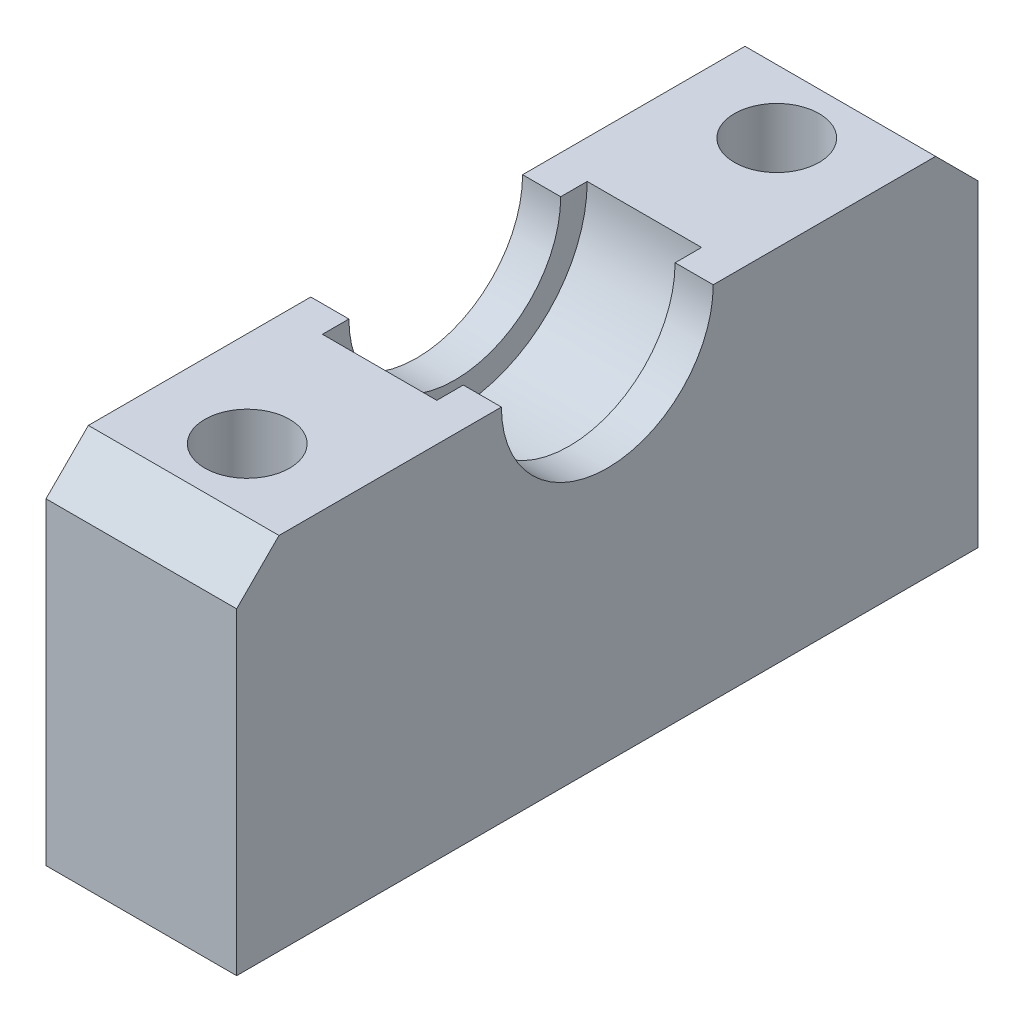
ISO-10303-21;
HEADER;
FILE_DESCRIPTION(('STEP AP214'),'2;1');
FILE_NAME('part.step','',(''),(''),'','','');
FILE_SCHEMA(('AUTOMOTIVE_DESIGN { 1 0 10303 214 1 1 1 1 }'));
ENDSEC;
DATA;
#1=APPLICATION_CONTEXT('core data for automotive mechanical design processes');
#2=APPLICATION_PROTOCOL_DEFINITION('international standard','automotive_design',2000,#1);
#3=PRODUCT_CONTEXT('',#1,'mechanical');
#4=PRODUCT('Part','Part','',(#3));
#5=PRODUCT_RELATED_PRODUCT_CATEGORY('part','',(#4));
#6=PRODUCT_DEFINITION_FORMATION('','',#4);
#7=PRODUCT_DEFINITION_CONTEXT('part definition',#1,'design');
#8=PRODUCT_DEFINITION('design','',#6,#7);
#9=PRODUCT_DEFINITION_SHAPE('','',#8);
#10=(LENGTH_UNIT() NAMED_UNIT(*) SI_UNIT(.MILLI.,.METRE.));
#11=(NAMED_UNIT(*) PLANE_ANGLE_UNIT() SI_UNIT($,.RADIAN.));
#12=(NAMED_UNIT(*) SI_UNIT($,.STERADIAN.) SOLID_ANGLE_UNIT());
#13=UNCERTAINTY_MEASURE_WITH_UNIT(LENGTH_MEASURE(1.E-05),#10,'distance_accuracy_value','');
#14=(GEOMETRIC_REPRESENTATION_CONTEXT(3) GLOBAL_UNCERTAINTY_ASSIGNED_CONTEXT((#13)) GLOBAL_UNIT_ASSIGNED_CONTEXT((#10,
#11,#12)) REPRESENTATION_CONTEXT('',''));
#15=CARTESIAN_POINT('',(0.,0.,0.));
#16=DIRECTION('',(0.,0.,1.));
#17=DIRECTION('',(1.,0.,0.));
#18=AXIS2_PLACEMENT_3D('',#15,#16,#17);
#19=CARTESIAN_POINT('',(-4.5,8.5,0.));
#20=DIRECTION('',(1.,0.,0.));
#21=DIRECTION('',(0.,0.,-1.));
#22=AXIS2_PLACEMENT_3D('',#19,#20,#21);
#23=CYLINDRICAL_SURFACE('',#22,5.);
#24=DIRECTION('',(1.,0.,0.));
#25=VECTOR('',#24,1.);
#26=CARTESIAN_POINT('',(-4.5,8.5,5.));
#27=LINE('',#26,#25);
#28=CARTESIAN_POINT('',(-4.5,8.5,5.));
#29=VERTEX_POINT('',#28);
#30=CARTESIAN_POINT('',(-2.7,8.5,5.));
#31=VERTEX_POINT('',#30);
#32=EDGE_CURVE('E222',#29,#31,#27,.T.);
#33=ORIENTED_EDGE('',*,*,#32,.T.);
#34=CARTESIAN_POINT('',(-2.7,8.5,0.));
#35=DIRECTION('',(1.,0.,0.));
#36=DIRECTION('',(0.,0.,-1.));
#37=AXIS2_PLACEMENT_3D('',#34,#35,#36);
#38=CIRCLE('',#37,5.);
#39=CARTESIAN_POINT('',(-2.7,8.5,-5.));
#40=VERTEX_POINT('',#39);
#41=EDGE_CURVE('E141',#31,#40,#38,.T.);
#42=ORIENTED_EDGE('',*,*,#41,.T.);
#43=DIRECTION('',(1.,0.,0.));
#44=VECTOR('',#43,1.);
#45=CARTESIAN_POINT('',(-4.5,8.5,-5.));
#46=LINE('',#45,#44);
#47=CARTESIAN_POINT('',(-4.5,8.5,-5.));
#48=VERTEX_POINT('',#47);
#49=EDGE_CURVE('E226',#48,#40,#46,.T.);
#50=ORIENTED_EDGE('',*,*,#49,.F.);
#51=CARTESIAN_POINT('',(-4.5,8.5,0.));
#52=DIRECTION('',(-1.,0.,0.));
#53=DIRECTION('',(0.,0.,-1.));
#54=AXIS2_PLACEMENT_3D('',#51,#52,#53);
#55=CIRCLE('',#54,5.);
#56=EDGE_CURVE('E199',#48,#29,#55,.T.);
#57=ORIENTED_EDGE('',*,*,#56,.T.);
#58=EDGE_LOOP('',(#33,#42,#50,#57));
#59=FACE_BOUND('',#58,.T.);
#60=ADVANCED_FACE('F45',(#59),#23,.F.);
#61=CARTESIAN_POINT('',(-4.5,-8.5,-17.5));
#62=DIRECTION('',(0.,0.,-1.));
#63=DIRECTION('',(-1.,0.,0.));
#64=AXIS2_PLACEMENT_3D('',#61,#62,#63);
#65=PLANE('',#64);
#66=DIRECTION('',(0.,1.,0.));
#67=VECTOR('',#66,1.);
#68=CARTESIAN_POINT('',(-4.5,-8.5,-17.5));
#69=LINE('',#68,#67);
#70=CARTESIAN_POINT('',(-4.5,-8.5,-17.5));
#71=VERTEX_POINT('',#70);
#72=CARTESIAN_POINT('',(-4.5,6.5,-17.5));
#73=VERTEX_POINT('',#72);
#74=EDGE_CURVE('E192',#71,#73,#69,.T.);
#75=ORIENTED_EDGE('',*,*,#74,.T.);
#76=DIRECTION('',(1.,0.,0.));
#77=VECTOR('',#76,1.);
#78=CARTESIAN_POINT('',(-4.5,6.5,-17.5));
#79=LINE('',#78,#77);
#80=CARTESIAN_POINT('',(4.5,6.5,-17.5));
#81=VERTEX_POINT('',#80);
#82=EDGE_CURVE('E237',#73,#81,#79,.T.);
#83=ORIENTED_EDGE('',*,*,#82,.T.);
#84=DIRECTION('',(0.,1.,0.));
#85=VECTOR('',#84,1.);
#86=CARTESIAN_POINT('',(4.5,-8.5,-17.5));
#87=LINE('',#86,#85);
#88=CARTESIAN_POINT('',(4.5,-8.5,-17.5));
#89=VERTEX_POINT('',#88);
#90=EDGE_CURVE('E165',#89,#81,#87,.T.);
#91=ORIENTED_EDGE('',*,*,#90,.F.);
#92=DIRECTION('',(1.,0.,0.));
#93=VECTOR('',#92,1.);
#94=CARTESIAN_POINT('',(-4.5,-8.5,-17.5));
#95=LINE('',#94,#93);
#96=EDGE_CURVE('E214',#71,#89,#95,.T.);
#97=ORIENTED_EDGE('',*,*,#96,.F.);
#98=EDGE_LOOP('',(#75,#83,#91,#97));
#99=FACE_BOUND('',#98,.T.);
#100=ADVANCED_FACE('F319',(#99),#65,.T.);
#101=CARTESIAN_POINT('',(-4.5,-8.5,17.5));
#102=DIRECTION('',(0.,-1.,0.));
#103=DIRECTION('',(0.,0.,-1.));
#104=AXIS2_PLACEMENT_3D('',#101,#102,#103);
#105=PLANE('',#104);
#106=CARTESIAN_POINT('',(0.,-8.5,-12.5));
#107=DIRECTION('',(0.,1.,0.));
#108=DIRECTION('',(0.,0.,1.));
#109=AXIS2_PLACEMENT_3D('',#106,#107,#108);
#110=CIRCLE('',#109,2.);
#111=CARTESIAN_POINT('',(0.,-8.5,-10.5));
#112=VERTEX_POINT('',#111);
#113=EDGE_CURVE('E158',#112,#112,#110,.T.);
#114=ORIENTED_EDGE('',*,*,#113,.T.);
#115=EDGE_LOOP('',(#114));
#116=FACE_BOUND('',#115,.T.);
#117=CARTESIAN_POINT('',(0.,-8.5,12.5));
#118=DIRECTION('',(0.,1.,0.));
#119=DIRECTION('',(0.,0.,1.));
#120=AXIS2_PLACEMENT_3D('',#117,#118,#119);
#121=CIRCLE('',#120,2.);
#122=CARTESIAN_POINT('',(0.,-8.5,14.5));
#123=VERTEX_POINT('',#122);
#124=EDGE_CURVE('E282',#123,#123,#121,.T.);
#125=ORIENTED_EDGE('',*,*,#124,.T.);
#126=EDGE_LOOP('',(#125));
#127=FACE_BOUND('',#126,.T.);
#128=ORIENTED_EDGE('',*,*,#96,.T.);
#129=DIRECTION('',(0.,0.,-1.));
#130=VECTOR('',#129,1.);
#131=CARTESIAN_POINT('',(4.5,-8.5,17.5));
#132=LINE('',#131,#130);
#133=CARTESIAN_POINT('',(4.5,-8.5,17.5));
#134=VERTEX_POINT('',#133);
#135=EDGE_CURVE('E188',#134,#89,#132,.T.);
#136=ORIENTED_EDGE('',*,*,#135,.F.);
#137=DIRECTION('',(1.,0.,0.));
#138=VECTOR('',#137,1.);
#139=CARTESIAN_POINT('',(-4.5,-8.5,17.5));
#140=LINE('',#139,#138);
#141=CARTESIAN_POINT('',(-4.5,-8.5,17.5));
#142=VERTEX_POINT('',#141);
#143=EDGE_CURVE('E218',#142,#134,#140,.T.);
#144=ORIENTED_EDGE('',*,*,#143,.F.);
#145=DIRECTION('',(0.,0.,-1.));
#146=VECTOR('',#145,1.);
#147=CARTESIAN_POINT('',(-4.5,-8.5,17.5));
#148=LINE('',#147,#146);
#149=EDGE_CURVE('E209',#142,#71,#148,.T.);
#150=ORIENTED_EDGE('',*,*,#149,.T.);
#151=EDGE_LOOP('',(#128,#136,#144,#150));
#152=FACE_BOUND('',#151,.T.);
#153=ADVANCED_FACE('F298',(#116,#127,#152),#105,.T.);
#154=CARTESIAN_POINT('',(-4.5,-8.5,17.5));
#155=DIRECTION('',(0.,0.,1.));
#156=DIRECTION('',(1.,0.,0.));
#157=AXIS2_PLACEMENT_3D('',#154,#155,#156);
#158=PLANE('',#157);
#159=DIRECTION('',(0.,-1.,0.));
#160=VECTOR('',#159,1.);
#161=CARTESIAN_POINT('',(4.5,-8.5,17.5));
#162=LINE('',#161,#160);
#163=CARTESIAN_POINT('',(4.5,6.49999999999999,17.5));
#164=VERTEX_POINT('',#163);
#165=EDGE_CURVE('E185',#164,#134,#162,.T.);
#166=ORIENTED_EDGE('',*,*,#165,.F.);
#167=DIRECTION('',(-1.,0.,0.));
#168=VECTOR('',#167,1.);
#169=CARTESIAN_POINT('',(-4.5,6.49999999999999,17.5));
#170=LINE('',#169,#168);
#171=CARTESIAN_POINT('',(-4.5,6.49999999999999,17.5));
#172=VERTEX_POINT('',#171);
#173=EDGE_CURVE('E11',#164,#172,#170,.T.);
#174=ORIENTED_EDGE('',*,*,#173,.T.);
#175=DIRECTION('',(0.,-1.,0.));
#176=VECTOR('',#175,1.);
#177=CARTESIAN_POINT('',(-4.5,-8.5,17.5));
#178=LINE('',#177,#176);
#179=EDGE_CURVE('E206',#172,#142,#178,.T.);
#180=ORIENTED_EDGE('',*,*,#179,.T.);
#181=ORIENTED_EDGE('',*,*,#143,.T.);
#182=EDGE_LOOP('',(#166,#174,#180,#181));
#183=FACE_BOUND('',#182,.T.);
#184=ADVANCED_FACE('F328',(#183),#158,.T.);
#185=CARTESIAN_POINT('',(-4.5,8.5,17.5));
#186=DIRECTION('',(0.,1.,0.));
#187=DIRECTION('',(0.,0.,1.));
#188=AXIS2_PLACEMENT_3D('',#185,#186,#187);
#189=PLANE('',#188);
#190=CARTESIAN_POINT('',(0.,8.5,12.5));
#191=DIRECTION('',(0.,1.,0.));
#192=DIRECTION('',(0.,0.,1.));
#193=AXIS2_PLACEMENT_3D('',#190,#191,#192);
#194=CIRCLE('',#193,2.);
#195=CARTESIAN_POINT('',(0.,8.5,14.5));
#196=VERTEX_POINT('',#195);
#197=EDGE_CURVE('E286',#196,#196,#194,.T.);
#198=ORIENTED_EDGE('',*,*,#197,.F.);
#199=EDGE_LOOP('',(#198));
#200=FACE_BOUND('',#199,.T.);
#201=DIRECTION('',(0.,0.,1.));
#202=VECTOR('',#201,1.);
#203=CARTESIAN_POINT('',(-4.5,8.5,17.5));
#204=LINE('',#203,#202);
#205=CARTESIAN_POINT('',(-4.5,8.5,15.5));
#206=VERTEX_POINT('',#205);
#207=EDGE_CURVE('E203',#29,#206,#204,.T.);
#208=ORIENTED_EDGE('',*,*,#207,.T.);
#209=DIRECTION('',(1.,0.,0.));
#210=VECTOR('',#209,1.);
#211=CARTESIAN_POINT('',(-4.5,8.5,15.5));
#212=LINE('',#211,#210);
#213=CARTESIAN_POINT('',(4.5,8.5,15.5));
#214=VERTEX_POINT('',#213);
#215=EDGE_CURVE('E55',#206,#214,#212,.T.);
#216=ORIENTED_EDGE('',*,*,#215,.T.);
#217=DIRECTION('',(0.,0.,1.));
#218=VECTOR('',#217,1.);
#219=CARTESIAN_POINT('',(4.5,8.5,17.5));
#220=LINE('',#219,#218);
#221=CARTESIAN_POINT('',(4.5,8.5,5.));
#222=VERTEX_POINT('',#221);
#223=EDGE_CURVE('E181',#222,#214,#220,.T.);
#224=ORIENTED_EDGE('',*,*,#223,.F.);
#225=CARTESIAN_POINT('',(2.7,8.5,5.));
#226=VERTEX_POINT('',#225);
#227=EDGE_CURVE('E225',#226,#222,#27,.T.);
#228=ORIENTED_EDGE('',*,*,#227,.F.);
#229=DIRECTION('',(0.,0.,-1.));
#230=VECTOR('',#229,1.);
#231=CARTESIAN_POINT('',(2.7,8.5,17.5));
#232=LINE('',#231,#230);
#233=CARTESIAN_POINT('',(2.7,8.5,6.25));
#234=VERTEX_POINT('',#233);
#235=EDGE_CURVE('E163',#234,#226,#232,.T.);
#236=ORIENTED_EDGE('',*,*,#235,.F.);
#237=DIRECTION('',(-1.,0.,0.));
#238=VECTOR('',#237,1.);
#239=CARTESIAN_POINT('',(2.7,8.5,6.25));
#240=LINE('',#239,#238);
#241=CARTESIAN_POINT('',(-2.7,8.5,6.25));
#242=VERTEX_POINT('',#241);
#243=EDGE_CURVE('E151',#234,#242,#240,.T.);
#244=ORIENTED_EDGE('',*,*,#243,.T.);
#245=DIRECTION('',(0.,0.,-1.));
#246=VECTOR('',#245,1.);
#247=CARTESIAN_POINT('',(-2.7,8.5,17.5));
#248=LINE('',#247,#246);
#249=EDGE_CURVE('E135',#242,#31,#248,.T.);
#250=ORIENTED_EDGE('',*,*,#249,.T.);
#251=ORIENTED_EDGE('',*,*,#32,.F.);
#252=EDGE_LOOP('',(#208,#216,#224,#228,#236,#244,#250,#251));
#253=FACE_BOUND('',#252,.T.);
#254=ADVANCED_FACE('F161',(#200,#253),#189,.T.);
#255=CARTESIAN_POINT('',(2.7,8.5,0.));
#256=DIRECTION('',(1.,0.,0.));
#257=DIRECTION('',(0.,0.,-1.));
#258=AXIS2_PLACEMENT_3D('',#255,#256,#257);
#259=CIRCLE('',#258,5.);
#260=CARTESIAN_POINT('',(2.7,8.5,-5.));
#261=VERTEX_POINT('',#260);
#262=EDGE_CURVE('E146',#226,#261,#259,.T.);
#263=ORIENTED_EDGE('',*,*,#262,.F.);
#264=ORIENTED_EDGE('',*,*,#227,.T.);
#265=CARTESIAN_POINT('',(4.5,8.5,0.));
#266=DIRECTION('',(-1.,0.,0.));
#267=DIRECTION('',(0.,0.,-1.));
#268=AXIS2_PLACEMENT_3D('',#265,#266,#267);
#269=CIRCLE('',#268,5.);
#270=CARTESIAN_POINT('',(4.5,8.5,-5.));
#271=VERTEX_POINT('',#270);
#272=EDGE_CURVE('E177',#271,#222,#269,.T.);
#273=ORIENTED_EDGE('',*,*,#272,.F.);
#274=EDGE_CURVE('E213',#261,#271,#46,.T.);
#275=ORIENTED_EDGE('',*,*,#274,.F.);
#276=EDGE_LOOP('',(#263,#264,#273,#275));
#277=FACE_BOUND('',#276,.T.);
#278=ADVANCED_FACE('F267',(#277),#23,.F.);
#279=CARTESIAN_POINT('',(-4.5,8.5,-5.));
#280=DIRECTION('',(0.,1.,0.));
#281=DIRECTION('',(0.,0.,1.));
#282=AXIS2_PLACEMENT_3D('',#279,#280,#281);
#283=PLANE('',#282);
#284=CARTESIAN_POINT('',(0.,8.5,-12.5));
#285=DIRECTION('',(0.,1.,0.));
#286=DIRECTION('',(0.,0.,1.));
#287=AXIS2_PLACEMENT_3D('',#284,#285,#286);
#288=CIRCLE('',#287,2.);
#289=CARTESIAN_POINT('',(0.,8.5,-10.5));
#290=VERTEX_POINT('',#289);
#291=EDGE_CURVE('E290',#290,#290,#288,.T.);
#292=ORIENTED_EDGE('',*,*,#291,.F.);
#293=EDGE_LOOP('',(#292));
#294=FACE_BOUND('',#293,.T.);
#295=DIRECTION('',(0.,0.,1.));
#296=VECTOR('',#295,1.);
#297=CARTESIAN_POINT('',(4.5,8.5,-5.));
#298=LINE('',#297,#296);
#299=CARTESIAN_POINT('',(4.5,8.5,-15.5));
#300=VERTEX_POINT('',#299);
#301=EDGE_CURVE('E170',#300,#271,#298,.T.);
#302=ORIENTED_EDGE('',*,*,#301,.F.);
#303=DIRECTION('',(-1.,0.,0.));
#304=VECTOR('',#303,1.);
#305=CARTESIAN_POINT('',(-4.5,8.5,-15.5));
#306=LINE('',#305,#304);
#307=CARTESIAN_POINT('',(-4.5,8.5,-15.5));
#308=VERTEX_POINT('',#307);
#309=EDGE_CURVE('E247',#300,#308,#306,.T.);
#310=ORIENTED_EDGE('',*,*,#309,.T.);
#311=DIRECTION('',(0.,0.,1.));
#312=VECTOR('',#311,1.);
#313=CARTESIAN_POINT('',(-4.5,8.5,-5.));
#314=LINE('',#313,#312);
#315=EDGE_CURVE('E196',#308,#48,#314,.T.);
#316=ORIENTED_EDGE('',*,*,#315,.T.);
#317=ORIENTED_EDGE('',*,*,#49,.T.);
#318=DIRECTION('',(0.,0.,-1.));
#319=VECTOR('',#318,1.);
#320=CARTESIAN_POINT('',(-2.7,8.5,-5.));
#321=LINE('',#320,#319);
#322=CARTESIAN_POINT('',(-2.7,8.5,-6.25));
#323=VERTEX_POINT('',#322);
#324=EDGE_CURVE('E217',#40,#323,#321,.T.);
#325=ORIENTED_EDGE('',*,*,#324,.T.);
#326=DIRECTION('',(-1.,0.,0.));
#327=VECTOR('',#326,1.);
#328=CARTESIAN_POINT('',(2.7,8.5,-6.25));
#329=LINE('',#328,#327);
#330=CARTESIAN_POINT('',(2.7,8.5,-6.25));
#331=VERTEX_POINT('',#330);
#332=EDGE_CURVE('E154',#323,#331,#329,.F.);
#333=ORIENTED_EDGE('',*,*,#332,.T.);
#334=DIRECTION('',(0.,0.,-1.));
#335=VECTOR('',#334,1.);
#336=CARTESIAN_POINT('',(2.7,8.5,-5.));
#337=LINE('',#336,#335);
#338=EDGE_CURVE('E234',#261,#331,#337,.T.);
#339=ORIENTED_EDGE('',*,*,#338,.F.);
#340=ORIENTED_EDGE('',*,*,#274,.T.);
#341=EDGE_LOOP('',(#302,#310,#316,#317,#325,#333,#339,#340));
#342=FACE_BOUND('',#341,.T.);
#343=ADVANCED_FACE('F272',(#294,#342),#283,.T.);
#344=CARTESIAN_POINT('',(-4.5,8.5,0.));
#345=DIRECTION('',(1.,0.,0.));
#346=DIRECTION('',(0.,0.,-1.));
#347=AXIS2_PLACEMENT_3D('',#344,#345,#346);
#348=PLANE('',#347);
#349=ORIENTED_EDGE('',*,*,#315,.F.);
#350=DIRECTION('',(0.,0.707106781186547,0.707106781186548));
#351=VECTOR('',#350,1.);
#352=CARTESIAN_POINT('',(-4.5,6.5,-17.5));
#353=LINE('',#352,#351);
#354=EDGE_CURVE('E252',#308,#73,#353,.F.);
#355=ORIENTED_EDGE('',*,*,#354,.T.);
#356=ORIENTED_EDGE('',*,*,#74,.F.);
#357=ORIENTED_EDGE('',*,*,#149,.F.);
#358=ORIENTED_EDGE('',*,*,#179,.F.);
#359=DIRECTION('',(0.,-0.707106781186549,0.707106781186546));
#360=VECTOR('',#359,1.);
#361=CARTESIAN_POINT('',(-4.5,8.5,15.5));
#362=LINE('',#361,#360);
#363=EDGE_CURVE('E62',#172,#206,#362,.F.);
#364=ORIENTED_EDGE('',*,*,#363,.T.);
#365=ORIENTED_EDGE('',*,*,#207,.F.);
#366=ORIENTED_EDGE('',*,*,#56,.F.);
#367=EDGE_LOOP('',(#349,#355,#356,#357,#358,#364,#365,#366));
#368=FACE_BOUND('',#367,.T.);
#369=ADVANCED_FACE('F309',(#368),#348,.F.);
#370=CARTESIAN_POINT('',(4.5,8.5,0.));
#371=DIRECTION('',(1.,0.,0.));
#372=DIRECTION('',(0.,0.,-1.));
#373=AXIS2_PLACEMENT_3D('',#370,#371,#372);
#374=PLANE('',#373);
#375=ORIENTED_EDGE('',*,*,#90,.T.);
#376=DIRECTION('',(0.,-0.707106781186547,-0.707106781186548));
#377=VECTOR('',#376,1.);
#378=CARTESIAN_POINT('',(4.5,16.25,-7.74999999999999));
#379=LINE('',#378,#377);
#380=EDGE_CURVE('E244',#81,#300,#379,.F.);
#381=ORIENTED_EDGE('',*,*,#380,.T.);
#382=ORIENTED_EDGE('',*,*,#301,.T.);
#383=ORIENTED_EDGE('',*,*,#272,.T.);
#384=ORIENTED_EDGE('',*,*,#223,.T.);
#385=DIRECTION('',(0.,0.707106781186549,-0.707106781186546));
#386=VECTOR('',#385,1.);
#387=CARTESIAN_POINT('',(4.5,16.25,7.75000000000003));
#388=LINE('',#387,#386);
#389=EDGE_CURVE('E241',#214,#164,#388,.F.);
#390=ORIENTED_EDGE('',*,*,#389,.T.);
#391=ORIENTED_EDGE('',*,*,#165,.T.);
#392=ORIENTED_EDGE('',*,*,#135,.T.);
#393=EDGE_LOOP('',(#375,#381,#382,#383,#384,#390,#391,#392));
#394=FACE_BOUND('',#393,.T.);
#395=ADVANCED_FACE('F260',(#394),#374,.T.);
#396=CARTESIAN_POINT('',(2.7,8.5,0.));
#397=DIRECTION('',(-1.,0.,0.));
#398=DIRECTION('',(0.,0.,1.));
#399=AXIS2_PLACEMENT_3D('',#396,#397,#398);
#400=CYLINDRICAL_SURFACE('',#399,6.25);
#401=CARTESIAN_POINT('',(2.7,8.5,0.));
#402=DIRECTION('',(1.,0.,0.));
#403=DIRECTION('',(0.,0.,-1.));
#404=AXIS2_PLACEMENT_3D('',#401,#402,#403);
#405=CIRCLE('',#404,6.25);
#406=EDGE_CURVE('E157',#234,#331,#405,.T.);
#407=ORIENTED_EDGE('',*,*,#406,.T.);
#408=ORIENTED_EDGE('',*,*,#332,.F.);
#409=CARTESIAN_POINT('',(-2.7,8.5,0.));
#410=DIRECTION('',(1.,0.,0.));
#411=DIRECTION('',(0.,0.,-1.));
#412=AXIS2_PLACEMENT_3D('',#409,#410,#411);
#413=CIRCLE('',#412,6.25);
#414=EDGE_CURVE('E138',#242,#323,#413,.T.);
#415=ORIENTED_EDGE('',*,*,#414,.F.);
#416=ORIENTED_EDGE('',*,*,#243,.F.);
#417=EDGE_LOOP('',(#407,#408,#415,#416));
#418=FACE_BOUND('',#417,.T.);
#419=ADVANCED_FACE('F150',(#418),#400,.F.);
#420=CARTESIAN_POINT('',(2.7,8.5,0.));
#421=DIRECTION('',(1.,0.,0.));
#422=DIRECTION('',(0.,0.,-1.));
#423=AXIS2_PLACEMENT_3D('',#420,#421,#422);
#424=PLANE('',#423);
#425=ORIENTED_EDGE('',*,*,#235,.T.);
#426=ORIENTED_EDGE('',*,*,#262,.T.);
#427=ORIENTED_EDGE('',*,*,#338,.T.);
#428=ORIENTED_EDGE('',*,*,#406,.F.);
#429=EDGE_LOOP('',(#425,#426,#427,#428));
#430=FACE_BOUND('',#429,.T.);
#431=ADVANCED_FACE('F275',(#430),#424,.F.);
#432=CARTESIAN_POINT('',(-2.7,8.5,0.));
#433=DIRECTION('',(1.,0.,0.));
#434=DIRECTION('',(0.,0.,-1.));
#435=AXIS2_PLACEMENT_3D('',#432,#433,#434);
#436=PLANE('',#435);
#437=ORIENTED_EDGE('',*,*,#414,.T.);
#438=ORIENTED_EDGE('',*,*,#324,.F.);
#439=ORIENTED_EDGE('',*,*,#41,.F.);
#440=ORIENTED_EDGE('',*,*,#249,.F.);
#441=EDGE_LOOP('',(#437,#438,#439,#440));
#442=FACE_BOUND('',#441,.T.);
#443=ADVANCED_FACE('F137',(#442),#436,.T.);
#444=CARTESIAN_POINT('',(0.,-8.5,-12.5));
#445=DIRECTION('',(0.,1.,0.));
#446=DIRECTION('',(0.,0.,1.));
#447=AXIS2_PLACEMENT_3D('',#444,#445,#446);
#448=CYLINDRICAL_SURFACE('',#447,2.);
#449=ORIENTED_EDGE('',*,*,#113,.F.);
#450=EDGE_LOOP('',(#449));
#451=FACE_BOUND('',#450,.T.);
#452=ORIENTED_EDGE('',*,*,#291,.T.);
#453=EDGE_LOOP('',(#452));
#454=FACE_BOUND('',#453,.T.);
#455=ADVANCED_FACE('F301',(#451,#454),#448,.F.);
#456=CARTESIAN_POINT('',(0.,-8.5,12.5));
#457=DIRECTION('',(0.,1.,0.));
#458=DIRECTION('',(0.,0.,1.));
#459=AXIS2_PLACEMENT_3D('',#456,#457,#458);
#460=CYLINDRICAL_SURFACE('',#459,2.);
#461=ORIENTED_EDGE('',*,*,#124,.F.);
#462=EDGE_LOOP('',(#461));
#463=FACE_BOUND('',#462,.T.);
#464=ORIENTED_EDGE('',*,*,#197,.T.);
#465=EDGE_LOOP('',(#464));
#466=FACE_BOUND('',#465,.T.);
#467=ADVANCED_FACE('F304',(#463,#466),#460,.F.);
#468=CARTESIAN_POINT('',(-4.5,6.5,-17.5));
#469=DIRECTION('',(0.,-0.707106781186548,0.707106781186547));
#470=DIRECTION('',(1.,0.,0.));
#471=AXIS2_PLACEMENT_3D('',#468,#469,#470);
#472=PLANE('',#471);
#473=ORIENTED_EDGE('',*,*,#354,.F.);
#474=ORIENTED_EDGE('',*,*,#309,.F.);
#475=ORIENTED_EDGE('',*,*,#380,.F.);
#476=ORIENTED_EDGE('',*,*,#82,.F.);
#477=EDGE_LOOP('',(#473,#474,#475,#476));
#478=FACE_BOUND('',#477,.T.);
#479=ADVANCED_FACE('F343',(#478),#472,.F.);
#480=CARTESIAN_POINT('',(-4.5,8.5,15.5));
#481=DIRECTION('',(0.,-0.707106781186546,-0.707106781186549));
#482=DIRECTION('',(1.,0.,0.));
#483=AXIS2_PLACEMENT_3D('',#480,#481,#482);
#484=PLANE('',#483);
#485=ORIENTED_EDGE('',*,*,#363,.F.);
#486=ORIENTED_EDGE('',*,*,#173,.F.);
#487=ORIENTED_EDGE('',*,*,#389,.F.);
#488=ORIENTED_EDGE('',*,*,#215,.F.);
#489=EDGE_LOOP('',(#485,#486,#487,#488));
#490=FACE_BOUND('',#489,.T.);
#491=ADVANCED_FACE('F48',(#490),#484,.F.);
#492=CLOSED_SHELL('',(#60,#100,#153,#184,#254,#278,#343,#369,#395,#419,#431,#443,#455,#467,#479,#491));
#493=MANIFOLD_SOLID_BREP('B2',#492);
#494=ADVANCED_BREP_SHAPE_REPRESENTATION('',(#18,#493),#14);
#495=SHAPE_DEFINITION_REPRESENTATION(#9,#494);
ENDSEC;
END-ISO-10303-21;
